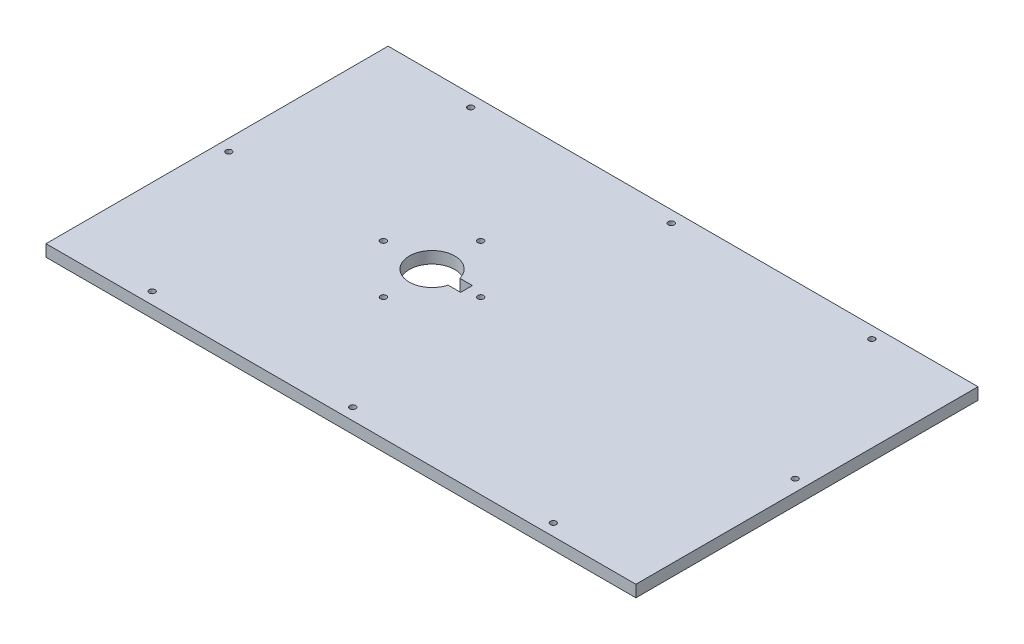
ISO-10303-21;
HEADER;
FILE_DESCRIPTION(('STEP AP214'),'2;1');
FILE_NAME('part.step','',(''),(''),'','','');
FILE_SCHEMA(('AUTOMOTIVE_DESIGN { 1 0 10303 214 1 1 1 1 }'));
ENDSEC;
DATA;
#1=APPLICATION_CONTEXT('core data for automotive mechanical design processes');
#2=APPLICATION_PROTOCOL_DEFINITION('international standard','automotive_design',2000,#1);
#3=PRODUCT_CONTEXT('',#1,'mechanical');
#4=PRODUCT('Part','Part','',(#3));
#5=PRODUCT_RELATED_PRODUCT_CATEGORY('part','',(#4));
#6=PRODUCT_DEFINITION_FORMATION('','',#4);
#7=PRODUCT_DEFINITION_CONTEXT('part definition',#1,'design');
#8=PRODUCT_DEFINITION('design','',#6,#7);
#9=PRODUCT_DEFINITION_SHAPE('','',#8);
#10=(LENGTH_UNIT() NAMED_UNIT(*) SI_UNIT(.MILLI.,.METRE.));
#11=(NAMED_UNIT(*) PLANE_ANGLE_UNIT() SI_UNIT($,.RADIAN.));
#12=(NAMED_UNIT(*) SI_UNIT($,.STERADIAN.) SOLID_ANGLE_UNIT());
#13=UNCERTAINTY_MEASURE_WITH_UNIT(LENGTH_MEASURE(1.E-05),#10,'distance_accuracy_value','');
#14=(GEOMETRIC_REPRESENTATION_CONTEXT(3) GLOBAL_UNCERTAINTY_ASSIGNED_CONTEXT((#13)) GLOBAL_UNIT_ASSIGNED_CONTEXT((#10,
#11,#12)) REPRESENTATION_CONTEXT('',''));
#15=CARTESIAN_POINT('',(0.,0.,0.));
#16=DIRECTION('',(0.,0.,1.));
#17=DIRECTION('',(1.,0.,0.));
#18=AXIS2_PLACEMENT_3D('',#15,#16,#17);
#19=CARTESIAN_POINT('',(0.,10.,0.));
#20=DIRECTION('',(0.,-1.,0.));
#21=DIRECTION('',(0.,0.,-1.));
#22=AXIS2_PLACEMENT_3D('',#19,#20,#21);
#23=PLANE('',#22);
#24=CARTESIAN_POINT('',(-67.7803366535844,10.,-41.25));
#25=DIRECTION('',(0.,1.,0.));
#26=DIRECTION('',(0.,0.,1.));
#27=AXIS2_PLACEMENT_3D('',#24,#25,#26);
#28=CIRCLE('',#27,2.49999999999999);
#29=CARTESIAN_POINT('',(-67.7803366535844,10.,-38.75));
#30=VERTEX_POINT('',#29);
#31=EDGE_CURVE('E134',#30,#30,#28,.T.);
#32=ORIENTED_EDGE('',*,*,#31,.F.);
#33=EDGE_LOOP('',(#32));
#34=FACE_BOUND('',#33,.T.);
#35=CARTESIAN_POINT('',(-109.030336653585,10.,-2.98150546547524E-13));
#36=DIRECTION('',(0.,1.,0.));
#37=DIRECTION('',(0.,0.,1.));
#38=AXIS2_PLACEMENT_3D('',#35,#36,#37);
#39=CIRCLE('',#38,2.49999999999999);
#40=CARTESIAN_POINT('',(-109.030336653585,10.,2.49999999999969));
#41=VERTEX_POINT('',#40);
#42=EDGE_CURVE('E140',#41,#41,#39,.T.);
#43=ORIENTED_EDGE('',*,*,#42,.F.);
#44=EDGE_LOOP('',(#43));
#45=FACE_BOUND('',#44,.T.);
#46=CARTESIAN_POINT('',(1.11022302462516E-13,10.,135.));
#47=DIRECTION('',(0.,1.,0.));
#48=DIRECTION('',(0.,0.,1.));
#49=AXIS2_PLACEMENT_3D('',#46,#47,#48);
#50=CIRCLE('',#49,2.5);
#51=CARTESIAN_POINT('',(1.11022302462516E-13,10.,137.5));
#52=VERTEX_POINT('',#51);
#53=EDGE_CURVE('E146',#52,#52,#50,.T.);
#54=ORIENTED_EDGE('',*,*,#53,.F.);
#55=EDGE_LOOP('',(#54));
#56=FACE_BOUND('',#55,.T.);
#57=CARTESIAN_POINT('',(1.11022302462516E-13,10.,-135.));
#58=DIRECTION('',(0.,1.,0.));
#59=DIRECTION('',(0.,0.,1.));
#60=AXIS2_PLACEMENT_3D('',#57,#58,#59);
#61=CIRCLE('',#60,2.5);
#62=CARTESIAN_POINT('',(1.11022302462516E-13,10.,-132.5));
#63=VERTEX_POINT('',#62);
#64=EDGE_CURVE('E152',#63,#63,#61,.T.);
#65=ORIENTED_EDGE('',*,*,#64,.F.);
#66=EDGE_LOOP('',(#65));
#67=FACE_BOUND('',#66,.T.);
#68=CARTESIAN_POINT('',(170.,10.,135.));
#69=DIRECTION('',(0.,1.,0.));
#70=DIRECTION('',(0.,0.,1.));
#71=AXIS2_PLACEMENT_3D('',#68,#69,#70);
#72=CIRCLE('',#71,2.5);
#73=CARTESIAN_POINT('',(170.,10.,137.5));
#74=VERTEX_POINT('',#73);
#75=EDGE_CURVE('E158',#74,#74,#72,.T.);
#76=ORIENTED_EDGE('',*,*,#75,.F.);
#77=EDGE_LOOP('',(#76));
#78=FACE_BOUND('',#77,.T.);
#79=CARTESIAN_POINT('',(240.,10.,0.));
#80=DIRECTION('',(0.,1.,0.));
#81=DIRECTION('',(0.,0.,1.));
#82=AXIS2_PLACEMENT_3D('',#79,#80,#81);
#83=CIRCLE('',#82,2.5);
#84=CARTESIAN_POINT('',(240.,10.,2.5));
#85=VERTEX_POINT('',#84);
#86=EDGE_CURVE('E164',#85,#85,#83,.T.);
#87=ORIENTED_EDGE('',*,*,#86,.F.);
#88=EDGE_LOOP('',(#87));
#89=FACE_BOUND('',#88,.T.);
#90=CARTESIAN_POINT('',(170.,10.,-135.));
#91=DIRECTION('',(0.,1.,0.));
#92=DIRECTION('',(0.,0.,1.));
#93=AXIS2_PLACEMENT_3D('',#90,#91,#92);
#94=CIRCLE('',#93,2.5);
#95=CARTESIAN_POINT('',(170.,10.,-132.5));
#96=VERTEX_POINT('',#95);
#97=EDGE_CURVE('E170',#96,#96,#94,.T.);
#98=ORIENTED_EDGE('',*,*,#97,.F.);
#99=EDGE_LOOP('',(#98));
#100=FACE_BOUND('',#99,.T.);
#101=CARTESIAN_POINT('',(-170.,10.,-135.));
#102=DIRECTION('',(0.,1.,0.));
#103=DIRECTION('',(0.,0.,1.));
#104=AXIS2_PLACEMENT_3D('',#101,#102,#103);
#105=CIRCLE('',#104,2.5);
#106=CARTESIAN_POINT('',(-170.,10.,-132.5));
#107=VERTEX_POINT('',#106);
#108=EDGE_CURVE('E176',#107,#107,#105,.T.);
#109=ORIENTED_EDGE('',*,*,#108,.F.);
#110=EDGE_LOOP('',(#109));
#111=FACE_BOUND('',#110,.T.);
#112=CARTESIAN_POINT('',(-170.,10.,135.));
#113=DIRECTION('',(0.,1.,0.));
#114=DIRECTION('',(0.,0.,1.));
#115=AXIS2_PLACEMENT_3D('',#112,#113,#114);
#116=CIRCLE('',#115,2.5);
#117=CARTESIAN_POINT('',(-170.,10.,137.5));
#118=VERTEX_POINT('',#117);
#119=EDGE_CURVE('E182',#118,#118,#116,.T.);
#120=ORIENTED_EDGE('',*,*,#119,.F.);
#121=EDGE_LOOP('',(#120));
#122=FACE_BOUND('',#121,.T.);
#123=CARTESIAN_POINT('',(-67.780336653585,10.,41.25));
#124=DIRECTION('',(0.,1.,0.));
#125=DIRECTION('',(0.,0.,1.));
#126=AXIS2_PLACEMENT_3D('',#123,#124,#125);
#127=CIRCLE('',#126,2.5);
#128=CARTESIAN_POINT('',(-67.780336653585,10.,43.75));
#129=VERTEX_POINT('',#128);
#130=EDGE_CURVE('E188',#129,#129,#127,.T.);
#131=ORIENTED_EDGE('',*,*,#130,.F.);
#132=EDGE_LOOP('',(#131));
#133=FACE_BOUND('',#132,.T.);
#134=CARTESIAN_POINT('',(-240.,10.,0.));
#135=DIRECTION('',(0.,1.,0.));
#136=DIRECTION('',(0.,0.,1.));
#137=AXIS2_PLACEMENT_3D('',#134,#135,#136);
#138=CIRCLE('',#137,2.5);
#139=CARTESIAN_POINT('',(-240.,10.,2.5));
#140=VERTEX_POINT('',#139);
#141=EDGE_CURVE('E194',#140,#140,#138,.T.);
#142=ORIENTED_EDGE('',*,*,#141,.F.);
#143=EDGE_LOOP('',(#142));
#144=FACE_BOUND('',#143,.T.);
#145=CARTESIAN_POINT('',(-26.5303366535848,10.,0.));
#146=DIRECTION('',(0.,1.,0.));
#147=DIRECTION('',(0.,0.,1.));
#148=AXIS2_PLACEMENT_3D('',#145,#146,#147);
#149=CIRCLE('',#148,2.5);
#150=CARTESIAN_POINT('',(-26.5303366535848,10.,2.5));
#151=VERTEX_POINT('',#150);
#152=EDGE_CURVE('E200',#151,#151,#149,.T.);
#153=ORIENTED_EDGE('',*,*,#152,.F.);
#154=EDGE_LOOP('',(#153));
#155=FACE_BOUND('',#154,.T.);
#156=DIRECTION('',(0.,0.,-1.));
#157=VECTOR('',#156,1.);
#158=CARTESIAN_POINT('',(250.,10.,145.));
#159=LINE('',#158,#157);
#160=CARTESIAN_POINT('',(250.,10.,145.));
#161=VERTEX_POINT('',#160);
#162=CARTESIAN_POINT('',(250.,10.,-145.));
#163=VERTEX_POINT('',#162);
#164=EDGE_CURVE('E206',#161,#163,#159,.T.);
#165=ORIENTED_EDGE('',*,*,#164,.T.);
#166=DIRECTION('',(-1.,0.,0.));
#167=VECTOR('',#166,1.);
#168=CARTESIAN_POINT('',(-250.,10.,-145.));
#169=LINE('',#168,#167);
#170=CARTESIAN_POINT('',(-250.,10.,-145.));
#171=VERTEX_POINT('',#170);
#172=EDGE_CURVE('E209',#163,#171,#169,.T.);
#173=ORIENTED_EDGE('',*,*,#172,.T.);
#174=DIRECTION('',(0.,0.,1.));
#175=VECTOR('',#174,1.);
#176=CARTESIAN_POINT('',(-250.,10.,145.));
#177=LINE('',#176,#175);
#178=CARTESIAN_POINT('',(-250.,10.,145.));
#179=VERTEX_POINT('',#178);
#180=EDGE_CURVE('E212',#171,#179,#177,.T.);
#181=ORIENTED_EDGE('',*,*,#180,.T.);
#182=DIRECTION('',(1.,0.,0.));
#183=VECTOR('',#182,1.);
#184=CARTESIAN_POINT('',(-250.,10.,145.));
#185=LINE('',#184,#183);
#186=EDGE_CURVE('E214',#179,#161,#185,.T.);
#187=ORIENTED_EDGE('',*,*,#186,.T.);
#188=EDGE_LOOP('',(#165,#173,#181,#187));
#189=FACE_BOUND('',#188,.T.);
#190=DIRECTION('',(0.,0.,-1.));
#191=VECTOR('',#190,1.);
#192=CARTESIAN_POINT('',(-38.5303366535849,10.,4.99999999999999));
#193=LINE('',#192,#191);
#194=CARTESIAN_POINT('',(-38.5303366535849,10.,4.99999999999999));
#195=VERTEX_POINT('',#194);
#196=CARTESIAN_POINT('',(-38.5303366535849,10.,-5.00000000000001));
#197=VERTEX_POINT('',#196);
#198=EDGE_CURVE('E98',#195,#197,#193,.T.);
#199=ORIENTED_EDGE('',*,*,#198,.F.);
#200=DIRECTION('',(1.,0.,0.));
#201=VECTOR('',#200,1.);
#202=CARTESIAN_POINT('',(-49.1910252085635,10.,4.99999999999999));
#203=LINE('',#202,#201);
#204=CARTESIAN_POINT('',(-49.1910252085635,10.,4.99999999999999));
#205=VERTEX_POINT('',#204);
#206=EDGE_CURVE('E120',#205,#195,#203,.T.);
#207=ORIENTED_EDGE('',*,*,#206,.F.);
#208=CARTESIAN_POINT('',(-67.7803366535849,10.,0.));
#209=DIRECTION('',(0.,1.,0.));
#210=DIRECTION('',(0.,0.,1.));
#211=AXIS2_PLACEMENT_3D('',#208,#209,#210);
#212=CIRCLE('',#211,19.25);
#213=CARTESIAN_POINT('',(-49.1910252085635,10.,-5.00000000000001));
#214=VERTEX_POINT('',#213);
#215=EDGE_CURVE('E118',#214,#205,#212,.T.);
#216=ORIENTED_EDGE('',*,*,#215,.F.);
#217=DIRECTION('',(-1.,0.,0.));
#218=VECTOR('',#217,1.);
#219=CARTESIAN_POINT('',(-49.1910252085635,10.,-5.00000000000001));
#220=LINE('',#219,#218);
#221=EDGE_CURVE('E106',#197,#214,#220,.T.);
#222=ORIENTED_EDGE('',*,*,#221,.F.);
#223=EDGE_LOOP('',(#199,#207,#216,#222));
#224=FACE_BOUND('',#223,.T.);
#225=ADVANCED_FACE('F33',(#34,#45,#56,#67,#78,#89,#100,#111,#122,#133,#144,#155,#189,#224),#23,.F.);
#226=CARTESIAN_POINT('',(0.,0.,0.));
#227=DIRECTION('',(0.,-1.,0.));
#228=DIRECTION('',(0.,0.,-1.));
#229=AXIS2_PLACEMENT_3D('',#226,#227,#228);
#230=PLANE('',#229);
#231=CARTESIAN_POINT('',(-109.030336653585,0.,-2.98150546547524E-13));
#232=DIRECTION('',(0.,1.,0.));
#233=DIRECTION('',(0.,0.,1.));
#234=AXIS2_PLACEMENT_3D('',#231,#232,#233);
#235=CIRCLE('',#234,2.49999999999999);
#236=CARTESIAN_POINT('',(-109.030336653585,0.,2.49999999999969));
#237=VERTEX_POINT('',#236);
#238=EDGE_CURVE('E137',#237,#237,#235,.T.);
#239=ORIENTED_EDGE('',*,*,#238,.T.);
#240=EDGE_LOOP('',(#239));
#241=FACE_BOUND('',#240,.T.);
#242=CARTESIAN_POINT('',(1.11022302462516E-13,0.,-135.));
#243=DIRECTION('',(0.,1.,0.));
#244=DIRECTION('',(0.,0.,1.));
#245=AXIS2_PLACEMENT_3D('',#242,#243,#244);
#246=CIRCLE('',#245,2.5);
#247=CARTESIAN_POINT('',(1.11022302462516E-13,0.,-132.5));
#248=VERTEX_POINT('',#247);
#249=EDGE_CURVE('E149',#248,#248,#246,.T.);
#250=ORIENTED_EDGE('',*,*,#249,.T.);
#251=EDGE_LOOP('',(#250));
#252=FACE_BOUND('',#251,.T.);
#253=CARTESIAN_POINT('',(240.,0.,0.));
#254=DIRECTION('',(0.,1.,0.));
#255=DIRECTION('',(0.,0.,1.));
#256=AXIS2_PLACEMENT_3D('',#253,#254,#255);
#257=CIRCLE('',#256,2.5);
#258=CARTESIAN_POINT('',(240.,0.,2.5));
#259=VERTEX_POINT('',#258);
#260=EDGE_CURVE('E161',#259,#259,#257,.T.);
#261=ORIENTED_EDGE('',*,*,#260,.T.);
#262=EDGE_LOOP('',(#261));
#263=FACE_BOUND('',#262,.T.);
#264=CARTESIAN_POINT('',(-170.,0.,-135.));
#265=DIRECTION('',(0.,1.,0.));
#266=DIRECTION('',(0.,0.,1.));
#267=AXIS2_PLACEMENT_3D('',#264,#265,#266);
#268=CIRCLE('',#267,2.5);
#269=CARTESIAN_POINT('',(-170.,0.,-132.5));
#270=VERTEX_POINT('',#269);
#271=EDGE_CURVE('E173',#270,#270,#268,.T.);
#272=ORIENTED_EDGE('',*,*,#271,.T.);
#273=EDGE_LOOP('',(#272));
#274=FACE_BOUND('',#273,.T.);
#275=CARTESIAN_POINT('',(-67.780336653585,0.,41.25));
#276=DIRECTION('',(0.,1.,0.));
#277=DIRECTION('',(0.,0.,1.));
#278=AXIS2_PLACEMENT_3D('',#275,#276,#277);
#279=CIRCLE('',#278,2.5);
#280=CARTESIAN_POINT('',(-67.780336653585,0.,43.75));
#281=VERTEX_POINT('',#280);
#282=EDGE_CURVE('E185',#281,#281,#279,.T.);
#283=ORIENTED_EDGE('',*,*,#282,.T.);
#284=EDGE_LOOP('',(#283));
#285=FACE_BOUND('',#284,.T.);
#286=CARTESIAN_POINT('',(-26.5303366535848,0.,0.));
#287=DIRECTION('',(0.,1.,0.));
#288=DIRECTION('',(0.,0.,1.));
#289=AXIS2_PLACEMENT_3D('',#286,#287,#288);
#290=CIRCLE('',#289,2.5);
#291=CARTESIAN_POINT('',(-26.5303366535848,0.,2.5));
#292=VERTEX_POINT('',#291);
#293=EDGE_CURVE('E197',#292,#292,#290,.T.);
#294=ORIENTED_EDGE('',*,*,#293,.T.);
#295=EDGE_LOOP('',(#294));
#296=FACE_BOUND('',#295,.T.);
#297=DIRECTION('',(0.,0.,-1.));
#298=VECTOR('',#297,1.);
#299=CARTESIAN_POINT('',(250.,0.,145.));
#300=LINE('',#299,#298);
#301=CARTESIAN_POINT('',(250.,0.,145.));
#302=VERTEX_POINT('',#301);
#303=CARTESIAN_POINT('',(250.,0.,-145.));
#304=VERTEX_POINT('',#303);
#305=EDGE_CURVE('E203',#302,#304,#300,.T.);
#306=ORIENTED_EDGE('',*,*,#305,.F.);
#307=DIRECTION('',(1.,0.,0.));
#308=VECTOR('',#307,1.);
#309=CARTESIAN_POINT('',(-250.,0.,145.));
#310=LINE('',#309,#308);
#311=CARTESIAN_POINT('',(-250.,0.,145.));
#312=VERTEX_POINT('',#311);
#313=EDGE_CURVE('E210',#312,#302,#310,.T.);
#314=ORIENTED_EDGE('',*,*,#313,.F.);
#315=DIRECTION('',(0.,0.,1.));
#316=VECTOR('',#315,1.);
#317=CARTESIAN_POINT('',(-250.,0.,145.));
#318=LINE('',#317,#316);
#319=CARTESIAN_POINT('',(-250.,0.,-145.));
#320=VERTEX_POINT('',#319);
#321=EDGE_CURVE('E221',#320,#312,#318,.T.);
#322=ORIENTED_EDGE('',*,*,#321,.F.);
#323=DIRECTION('',(-1.,0.,0.));
#324=VECTOR('',#323,1.);
#325=CARTESIAN_POINT('',(-250.,0.,-145.));
#326=LINE('',#325,#324);
#327=EDGE_CURVE('E219',#304,#320,#326,.T.);
#328=ORIENTED_EDGE('',*,*,#327,.F.);
#329=EDGE_LOOP('',(#306,#314,#322,#328));
#330=FACE_BOUND('',#329,.T.);
#331=CARTESIAN_POINT('',(-240.,0.,0.));
#332=DIRECTION('',(0.,1.,0.));
#333=DIRECTION('',(0.,0.,1.));
#334=AXIS2_PLACEMENT_3D('',#331,#332,#333);
#335=CIRCLE('',#334,2.5);
#336=CARTESIAN_POINT('',(-240.,0.,2.5));
#337=VERTEX_POINT('',#336);
#338=EDGE_CURVE('E191',#337,#337,#335,.T.);
#339=ORIENTED_EDGE('',*,*,#338,.T.);
#340=EDGE_LOOP('',(#339));
#341=FACE_BOUND('',#340,.T.);
#342=CARTESIAN_POINT('',(-170.,0.,135.));
#343=DIRECTION('',(0.,1.,0.));
#344=DIRECTION('',(0.,0.,1.));
#345=AXIS2_PLACEMENT_3D('',#342,#343,#344);
#346=CIRCLE('',#345,2.5);
#347=CARTESIAN_POINT('',(-170.,0.,137.5));
#348=VERTEX_POINT('',#347);
#349=EDGE_CURVE('E179',#348,#348,#346,.T.);
#350=ORIENTED_EDGE('',*,*,#349,.T.);
#351=EDGE_LOOP('',(#350));
#352=FACE_BOUND('',#351,.T.);
#353=CARTESIAN_POINT('',(170.,0.,-135.));
#354=DIRECTION('',(0.,1.,0.));
#355=DIRECTION('',(0.,0.,1.));
#356=AXIS2_PLACEMENT_3D('',#353,#354,#355);
#357=CIRCLE('',#356,2.5);
#358=CARTESIAN_POINT('',(170.,0.,-132.5));
#359=VERTEX_POINT('',#358);
#360=EDGE_CURVE('E167',#359,#359,#357,.T.);
#361=ORIENTED_EDGE('',*,*,#360,.T.);
#362=EDGE_LOOP('',(#361));
#363=FACE_BOUND('',#362,.T.);
#364=CARTESIAN_POINT('',(170.,0.,135.));
#365=DIRECTION('',(0.,1.,0.));
#366=DIRECTION('',(0.,0.,1.));
#367=AXIS2_PLACEMENT_3D('',#364,#365,#366);
#368=CIRCLE('',#367,2.5);
#369=CARTESIAN_POINT('',(170.,0.,137.5));
#370=VERTEX_POINT('',#369);
#371=EDGE_CURVE('E155',#370,#370,#368,.T.);
#372=ORIENTED_EDGE('',*,*,#371,.T.);
#373=EDGE_LOOP('',(#372));
#374=FACE_BOUND('',#373,.T.);
#375=CARTESIAN_POINT('',(1.11022302462516E-13,0.,135.));
#376=DIRECTION('',(0.,1.,0.));
#377=DIRECTION('',(0.,0.,1.));
#378=AXIS2_PLACEMENT_3D('',#375,#376,#377);
#379=CIRCLE('',#378,2.5);
#380=CARTESIAN_POINT('',(1.11022302462516E-13,0.,137.5));
#381=VERTEX_POINT('',#380);
#382=EDGE_CURVE('E143',#381,#381,#379,.T.);
#383=ORIENTED_EDGE('',*,*,#382,.T.);
#384=EDGE_LOOP('',(#383));
#385=FACE_BOUND('',#384,.T.);
#386=CARTESIAN_POINT('',(-67.7803366535844,0.,-41.25));
#387=DIRECTION('',(0.,1.,0.));
#388=DIRECTION('',(0.,0.,1.));
#389=AXIS2_PLACEMENT_3D('',#386,#387,#388);
#390=CIRCLE('',#389,2.49999999999999);
#391=CARTESIAN_POINT('',(-67.7803366535844,0.,-38.75));
#392=VERTEX_POINT('',#391);
#393=EDGE_CURVE('E114',#392,#392,#390,.T.);
#394=ORIENTED_EDGE('',*,*,#393,.T.);
#395=EDGE_LOOP('',(#394));
#396=FACE_BOUND('',#395,.T.);
#397=DIRECTION('',(1.,0.,0.));
#398=VECTOR('',#397,1.);
#399=CARTESIAN_POINT('',(-49.1910252085635,0.,4.99999999999999));
#400=LINE('',#399,#398);
#401=CARTESIAN_POINT('',(-49.1910252085635,0.,4.99999999999999));
#402=VERTEX_POINT('',#401);
#403=CARTESIAN_POINT('',(-38.5303366535849,0.,4.99999999999999));
#404=VERTEX_POINT('',#403);
#405=EDGE_CURVE('E107',#402,#404,#400,.T.);
#406=ORIENTED_EDGE('',*,*,#405,.T.);
#407=DIRECTION('',(0.,0.,-1.));
#408=VECTOR('',#407,1.);
#409=CARTESIAN_POINT('',(-38.5303366535849,0.,4.99999999999999));
#410=LINE('',#409,#408);
#411=CARTESIAN_POINT('',(-38.5303366535849,0.,-5.00000000000001));
#412=VERTEX_POINT('',#411);
#413=EDGE_CURVE('E56',#404,#412,#410,.T.);
#414=ORIENTED_EDGE('',*,*,#413,.T.);
#415=DIRECTION('',(-1.,0.,0.));
#416=VECTOR('',#415,1.);
#417=CARTESIAN_POINT('',(-49.1910252085635,0.,-5.00000000000001));
#418=LINE('',#417,#416);
#419=CARTESIAN_POINT('',(-49.1910252085635,0.,-5.00000000000001));
#420=VERTEX_POINT('',#419);
#421=EDGE_CURVE('E113',#412,#420,#418,.T.);
#422=ORIENTED_EDGE('',*,*,#421,.T.);
#423=CARTESIAN_POINT('',(-67.7803366535849,0.,0.));
#424=DIRECTION('',(0.,1.,0.));
#425=DIRECTION('',(0.,0.,1.));
#426=AXIS2_PLACEMENT_3D('',#423,#424,#425);
#427=CIRCLE('',#426,19.25);
#428=EDGE_CURVE('E126',#420,#402,#427,.T.);
#429=ORIENTED_EDGE('',*,*,#428,.T.);
#430=EDGE_LOOP('',(#406,#414,#422,#429));
#431=FACE_BOUND('',#430,.T.);
#432=ADVANCED_FACE('F239',(#241,#252,#263,#274,#285,#296,#330,#341,#352,#363,#374,#385,#396,
#431),#230,.T.);
#433=CARTESIAN_POINT('',(250.,10.,145.));
#434=DIRECTION('',(-1.,0.,0.));
#435=DIRECTION('',(0.,0.,1.));
#436=AXIS2_PLACEMENT_3D('',#433,#434,#435);
#437=PLANE('',#436);
#438=ORIENTED_EDGE('',*,*,#305,.T.);
#439=DIRECTION('',(0.,-1.,0.));
#440=VECTOR('',#439,1.);
#441=CARTESIAN_POINT('',(250.,10.,-145.));
#442=LINE('',#441,#440);
#443=EDGE_CURVE('E11',#163,#304,#442,.T.);
#444=ORIENTED_EDGE('',*,*,#443,.F.);
#445=ORIENTED_EDGE('',*,*,#164,.F.);
#446=DIRECTION('',(0.,-1.,0.));
#447=VECTOR('',#446,1.);
#448=CARTESIAN_POINT('',(250.,10.,145.));
#449=LINE('',#448,#447);
#450=EDGE_CURVE('E216',#161,#302,#449,.T.);
#451=ORIENTED_EDGE('',*,*,#450,.T.);
#452=EDGE_LOOP('',(#438,#444,#445,#451));
#453=FACE_BOUND('',#452,.T.);
#454=ADVANCED_FACE('F35',(#453),#437,.F.);
#455=CARTESIAN_POINT('',(-250.,10.,-145.));
#456=DIRECTION('',(0.,0.,1.));
#457=DIRECTION('',(1.,0.,0.));
#458=AXIS2_PLACEMENT_3D('',#455,#456,#457);
#459=PLANE('',#458);
#460=ORIENTED_EDGE('',*,*,#327,.T.);
#461=DIRECTION('',(0.,-1.,0.));
#462=VECTOR('',#461,1.);
#463=CARTESIAN_POINT('',(-250.,10.,-145.));
#464=LINE('',#463,#462);
#465=EDGE_CURVE('E41',#171,#320,#464,.T.);
#466=ORIENTED_EDGE('',*,*,#465,.F.);
#467=ORIENTED_EDGE('',*,*,#172,.F.);
#468=ORIENTED_EDGE('',*,*,#443,.T.);
#469=EDGE_LOOP('',(#460,#466,#467,#468));
#470=FACE_BOUND('',#469,.T.);
#471=ADVANCED_FACE('F249',(#470),#459,.F.);
#472=CARTESIAN_POINT('',(-250.,10.,145.));
#473=DIRECTION('',(1.,0.,0.));
#474=DIRECTION('',(0.,0.,-1.));
#475=AXIS2_PLACEMENT_3D('',#472,#473,#474);
#476=PLANE('',#475);
#477=ORIENTED_EDGE('',*,*,#321,.T.);
#478=DIRECTION('',(0.,-1.,0.));
#479=VECTOR('',#478,1.);
#480=CARTESIAN_POINT('',(-250.,10.,145.));
#481=LINE('',#480,#479);
#482=EDGE_CURVE('E226',#179,#312,#481,.T.);
#483=ORIENTED_EDGE('',*,*,#482,.F.);
#484=ORIENTED_EDGE('',*,*,#180,.F.);
#485=ORIENTED_EDGE('',*,*,#465,.T.);
#486=EDGE_LOOP('',(#477,#483,#484,#485));
#487=FACE_BOUND('',#486,.T.);
#488=ADVANCED_FACE('F233',(#487),#476,.F.);
#489=CARTESIAN_POINT('',(-250.,10.,145.));
#490=DIRECTION('',(0.,0.,-1.));
#491=DIRECTION('',(-1.,0.,0.));
#492=AXIS2_PLACEMENT_3D('',#489,#490,#491);
#493=PLANE('',#492);
#494=ORIENTED_EDGE('',*,*,#313,.T.);
#495=ORIENTED_EDGE('',*,*,#450,.F.);
#496=ORIENTED_EDGE('',*,*,#186,.F.);
#497=ORIENTED_EDGE('',*,*,#482,.T.);
#498=EDGE_LOOP('',(#494,#495,#496,#497));
#499=FACE_BOUND('',#498,.T.);
#500=ADVANCED_FACE('F243',(#499),#493,.F.);
#501=CARTESIAN_POINT('',(-26.5303366535848,10.,0.));
#502=DIRECTION('',(0.,-1.,0.));
#503=DIRECTION('',(0.,0.,-1.));
#504=AXIS2_PLACEMENT_3D('',#501,#502,#503);
#505=CYLINDRICAL_SURFACE('',#504,2.5);
#506=ORIENTED_EDGE('',*,*,#152,.T.);
#507=EDGE_LOOP('',(#506));
#508=FACE_BOUND('',#507,.T.);
#509=ORIENTED_EDGE('',*,*,#293,.F.);
#510=EDGE_LOOP('',(#509));
#511=FACE_BOUND('',#510,.T.);
#512=ADVANCED_FACE('F267',(#508,#511),#505,.F.);
#513=CARTESIAN_POINT('',(-240.,10.,0.));
#514=DIRECTION('',(0.,-1.,0.));
#515=DIRECTION('',(0.,0.,-1.));
#516=AXIS2_PLACEMENT_3D('',#513,#514,#515);
#517=CYLINDRICAL_SURFACE('',#516,2.5);
#518=ORIENTED_EDGE('',*,*,#141,.T.);
#519=EDGE_LOOP('',(#518));
#520=FACE_BOUND('',#519,.T.);
#521=ORIENTED_EDGE('',*,*,#338,.F.);
#522=EDGE_LOOP('',(#521));
#523=FACE_BOUND('',#522,.T.);
#524=ADVANCED_FACE('F274',(#520,#523),#517,.F.);
#525=CARTESIAN_POINT('',(-67.780336653585,10.,41.25));
#526=DIRECTION('',(0.,-1.,0.));
#527=DIRECTION('',(0.,0.,-1.));
#528=AXIS2_PLACEMENT_3D('',#525,#526,#527);
#529=CYLINDRICAL_SURFACE('',#528,2.5);
#530=ORIENTED_EDGE('',*,*,#130,.T.);
#531=EDGE_LOOP('',(#530));
#532=FACE_BOUND('',#531,.T.);
#533=ORIENTED_EDGE('',*,*,#282,.F.);
#534=EDGE_LOOP('',(#533));
#535=FACE_BOUND('',#534,.T.);
#536=ADVANCED_FACE('F279',(#532,#535),#529,.F.);
#537=CARTESIAN_POINT('',(-170.,10.,135.));
#538=DIRECTION('',(0.,-1.,0.));
#539=DIRECTION('',(0.,0.,-1.));
#540=AXIS2_PLACEMENT_3D('',#537,#538,#539);
#541=CYLINDRICAL_SURFACE('',#540,2.5);
#542=ORIENTED_EDGE('',*,*,#119,.T.);
#543=EDGE_LOOP('',(#542));
#544=FACE_BOUND('',#543,.T.);
#545=ORIENTED_EDGE('',*,*,#349,.F.);
#546=EDGE_LOOP('',(#545));
#547=FACE_BOUND('',#546,.T.);
#548=ADVANCED_FACE('F289',(#544,#547),#541,.F.);
#549=CARTESIAN_POINT('',(-170.,10.,-135.));
#550=DIRECTION('',(0.,-1.,0.));
#551=DIRECTION('',(0.,0.,-1.));
#552=AXIS2_PLACEMENT_3D('',#549,#550,#551);
#553=CYLINDRICAL_SURFACE('',#552,2.5);
#554=ORIENTED_EDGE('',*,*,#108,.T.);
#555=EDGE_LOOP('',(#554));
#556=FACE_BOUND('',#555,.T.);
#557=ORIENTED_EDGE('',*,*,#271,.F.);
#558=EDGE_LOOP('',(#557));
#559=FACE_BOUND('',#558,.T.);
#560=ADVANCED_FACE('F296',(#556,#559),#553,.F.);
#561=CARTESIAN_POINT('',(170.,10.,-135.));
#562=DIRECTION('',(0.,-1.,0.));
#563=DIRECTION('',(0.,0.,-1.));
#564=AXIS2_PLACEMENT_3D('',#561,#562,#563);
#565=CYLINDRICAL_SURFACE('',#564,2.5);
#566=ORIENTED_EDGE('',*,*,#97,.T.);
#567=EDGE_LOOP('',(#566));
#568=FACE_BOUND('',#567,.T.);
#569=ORIENTED_EDGE('',*,*,#360,.F.);
#570=EDGE_LOOP('',(#569));
#571=FACE_BOUND('',#570,.T.);
#572=ADVANCED_FACE('F300',(#568,#571),#565,.F.);
#573=CARTESIAN_POINT('',(240.,10.,0.));
#574=DIRECTION('',(0.,-1.,0.));
#575=DIRECTION('',(0.,0.,-1.));
#576=AXIS2_PLACEMENT_3D('',#573,#574,#575);
#577=CYLINDRICAL_SURFACE('',#576,2.5);
#578=ORIENTED_EDGE('',*,*,#86,.T.);
#579=EDGE_LOOP('',(#578));
#580=FACE_BOUND('',#579,.T.);
#581=ORIENTED_EDGE('',*,*,#260,.F.);
#582=EDGE_LOOP('',(#581));
#583=FACE_BOUND('',#582,.T.);
#584=ADVANCED_FACE('F304',(#580,#583),#577,.F.);
#585=CARTESIAN_POINT('',(170.,10.,135.));
#586=DIRECTION('',(0.,-1.,0.));
#587=DIRECTION('',(0.,0.,-1.));
#588=AXIS2_PLACEMENT_3D('',#585,#586,#587);
#589=CYLINDRICAL_SURFACE('',#588,2.5);
#590=ORIENTED_EDGE('',*,*,#75,.T.);
#591=EDGE_LOOP('',(#590));
#592=FACE_BOUND('',#591,.T.);
#593=ORIENTED_EDGE('',*,*,#371,.F.);
#594=EDGE_LOOP('',(#593));
#595=FACE_BOUND('',#594,.T.);
#596=ADVANCED_FACE('F308',(#592,#595),#589,.F.);
#597=CARTESIAN_POINT('',(1.11022302462516E-13,10.,-135.));
#598=DIRECTION('',(0.,-1.,0.));
#599=DIRECTION('',(0.,0.,-1.));
#600=AXIS2_PLACEMENT_3D('',#597,#598,#599);
#601=CYLINDRICAL_SURFACE('',#600,2.5);
#602=ORIENTED_EDGE('',*,*,#64,.T.);
#603=EDGE_LOOP('',(#602));
#604=FACE_BOUND('',#603,.T.);
#605=ORIENTED_EDGE('',*,*,#249,.F.);
#606=EDGE_LOOP('',(#605));
#607=FACE_BOUND('',#606,.T.);
#608=ADVANCED_FACE('F312',(#604,#607),#601,.F.);
#609=CARTESIAN_POINT('',(1.11022302462516E-13,10.,135.));
#610=DIRECTION('',(0.,-1.,0.));
#611=DIRECTION('',(0.,0.,-1.));
#612=AXIS2_PLACEMENT_3D('',#609,#610,#611);
#613=CYLINDRICAL_SURFACE('',#612,2.5);
#614=ORIENTED_EDGE('',*,*,#53,.T.);
#615=EDGE_LOOP('',(#614));
#616=FACE_BOUND('',#615,.T.);
#617=ORIENTED_EDGE('',*,*,#382,.F.);
#618=EDGE_LOOP('',(#617));
#619=FACE_BOUND('',#618,.T.);
#620=ADVANCED_FACE('F316',(#616,#619),#613,.F.);
#621=CARTESIAN_POINT('',(-109.030336653585,10.,-2.98150546547524E-13));
#622=DIRECTION('',(0.,-1.,0.));
#623=DIRECTION('',(0.,0.,-1.));
#624=AXIS2_PLACEMENT_3D('',#621,#622,#623);
#625=CYLINDRICAL_SURFACE('',#624,2.49999999999999);
#626=ORIENTED_EDGE('',*,*,#42,.T.);
#627=EDGE_LOOP('',(#626));
#628=FACE_BOUND('',#627,.T.);
#629=ORIENTED_EDGE('',*,*,#238,.F.);
#630=EDGE_LOOP('',(#629));
#631=FACE_BOUND('',#630,.T.);
#632=ADVANCED_FACE('F320',(#628,#631),#625,.F.);
#633=CARTESIAN_POINT('',(-67.7803366535844,10.,-41.25));
#634=DIRECTION('',(0.,-1.,0.));
#635=DIRECTION('',(0.,0.,-1.));
#636=AXIS2_PLACEMENT_3D('',#633,#634,#635);
#637=CYLINDRICAL_SURFACE('',#636,2.49999999999999);
#638=ORIENTED_EDGE('',*,*,#31,.T.);
#639=EDGE_LOOP('',(#638));
#640=FACE_BOUND('',#639,.T.);
#641=ORIENTED_EDGE('',*,*,#393,.F.);
#642=EDGE_LOOP('',(#641));
#643=FACE_BOUND('',#642,.T.);
#644=ADVANCED_FACE('F324',(#640,#643),#637,.F.);
#645=CARTESIAN_POINT('',(-38.5303366535849,10.,4.99999999999999));
#646=DIRECTION('',(-1.,0.,0.));
#647=DIRECTION('',(0.,0.,1.));
#648=AXIS2_PLACEMENT_3D('',#645,#646,#647);
#649=PLANE('',#648);
#650=ORIENTED_EDGE('',*,*,#413,.F.);
#651=DIRECTION('',(0.,-1.,0.));
#652=VECTOR('',#651,1.);
#653=CARTESIAN_POINT('',(-38.5303366535849,10.,4.99999999999999));
#654=LINE('',#653,#652);
#655=EDGE_CURVE('E102',#195,#404,#654,.T.);
#656=ORIENTED_EDGE('',*,*,#655,.F.);
#657=ORIENTED_EDGE('',*,*,#198,.T.);
#658=DIRECTION('',(0.,-1.,0.));
#659=VECTOR('',#658,1.);
#660=CARTESIAN_POINT('',(-38.5303366535849,10.,-5.00000000000001));
#661=LINE('',#660,#659);
#662=EDGE_CURVE('E101',#197,#412,#661,.T.);
#663=ORIENTED_EDGE('',*,*,#662,.T.);
#664=EDGE_LOOP('',(#650,#656,#657,#663));
#665=FACE_BOUND('',#664,.T.);
#666=ADVANCED_FACE('F100',(#665),#649,.T.);
#667=CARTESIAN_POINT('',(-49.1910252085635,10.,-5.00000000000001));
#668=DIRECTION('',(0.,0.,1.));
#669=DIRECTION('',(1.,0.,0.));
#670=AXIS2_PLACEMENT_3D('',#667,#668,#669);
#671=PLANE('',#670);
#672=ORIENTED_EDGE('',*,*,#421,.F.);
#673=ORIENTED_EDGE('',*,*,#662,.F.);
#674=ORIENTED_EDGE('',*,*,#221,.T.);
#675=DIRECTION('',(0.,-1.,0.));
#676=VECTOR('',#675,1.);
#677=CARTESIAN_POINT('',(-49.1910252085635,10.,-5.00000000000001));
#678=LINE('',#677,#676);
#679=EDGE_CURVE('E115',#214,#420,#678,.T.);
#680=ORIENTED_EDGE('',*,*,#679,.T.);
#681=EDGE_LOOP('',(#672,#673,#674,#680));
#682=FACE_BOUND('',#681,.T.);
#683=ADVANCED_FACE('F110',(#682),#671,.T.);
#684=CARTESIAN_POINT('',(-67.7803366535849,10.,0.));
#685=DIRECTION('',(0.,-1.,0.));
#686=DIRECTION('',(0.,0.,-1.));
#687=AXIS2_PLACEMENT_3D('',#684,#685,#686);
#688=CYLINDRICAL_SURFACE('',#687,19.25);
#689=ORIENTED_EDGE('',*,*,#428,.F.);
#690=ORIENTED_EDGE('',*,*,#679,.F.);
#691=ORIENTED_EDGE('',*,*,#215,.T.);
#692=DIRECTION('',(0.,-1.,0.));
#693=VECTOR('',#692,1.);
#694=CARTESIAN_POINT('',(-49.1910252085635,10.,4.99999999999999));
#695=LINE('',#694,#693);
#696=EDGE_CURVE('E48',#205,#402,#695,.T.);
#697=ORIENTED_EDGE('',*,*,#696,.T.);
#698=EDGE_LOOP('',(#689,#690,#691,#697));
#699=FACE_BOUND('',#698,.T.);
#700=ADVANCED_FACE('F333',(#699),#688,.F.);
#701=CARTESIAN_POINT('',(-49.1910252085635,10.,4.99999999999999));
#702=DIRECTION('',(0.,0.,-1.));
#703=DIRECTION('',(-1.,0.,0.));
#704=AXIS2_PLACEMENT_3D('',#701,#702,#703);
#705=PLANE('',#704);
#706=ORIENTED_EDGE('',*,*,#405,.F.);
#707=ORIENTED_EDGE('',*,*,#696,.F.);
#708=ORIENTED_EDGE('',*,*,#206,.T.);
#709=ORIENTED_EDGE('',*,*,#655,.T.);
#710=EDGE_LOOP('',(#706,#707,#708,#709));
#711=FACE_BOUND('',#710,.T.);
#712=ADVANCED_FACE('F336',(#711),#705,.T.);
#713=CLOSED_SHELL('',(#225,#432,#454,#471,#488,#500,#512,#524,#536,#548,#560,#572,#584,#596,
#608,#620,#632,#644,#666,#683,#700,#712));
#714=MANIFOLD_SOLID_BREP('B2',#713);
#715=ADVANCED_BREP_SHAPE_REPRESENTATION('',(#18,#714),#14);
#716=SHAPE_DEFINITION_REPRESENTATION(#9,#715);
ENDSEC;
END-ISO-10303-21;
